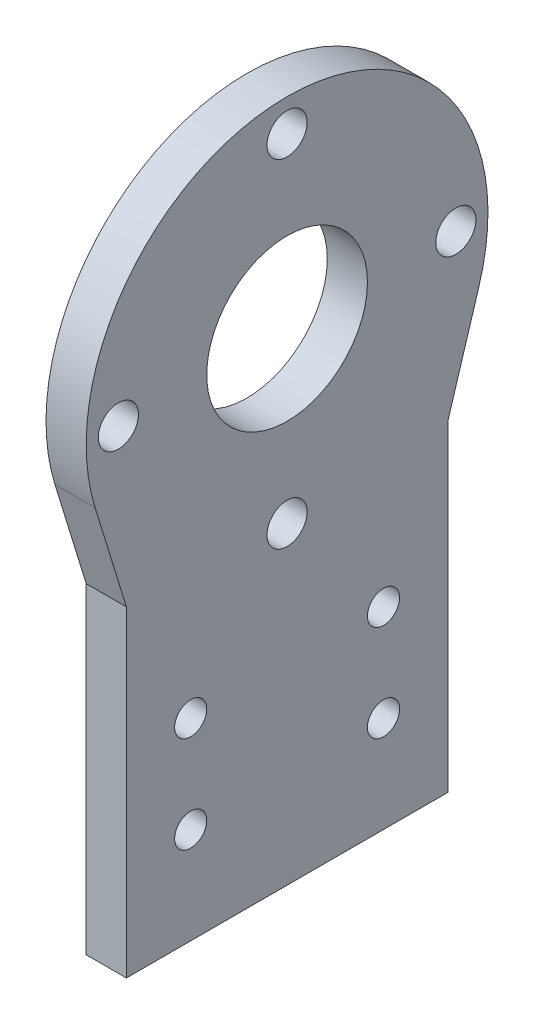
ISO-10303-21;
HEADER;
FILE_DESCRIPTION(('STEP AP214'),'2;1');
FILE_NAME('part.step','',(''),(''),'','','');
FILE_SCHEMA(('AUTOMOTIVE_DESIGN { 1 0 10303 214 1 1 1 1 }'));
ENDSEC;
DATA;
#1=APPLICATION_CONTEXT('core data for automotive mechanical design processes');
#2=APPLICATION_PROTOCOL_DEFINITION('international standard','automotive_design',2000,#1);
#3=PRODUCT_CONTEXT('',#1,'mechanical');
#4=PRODUCT('Part','Part','',(#3));
#5=PRODUCT_RELATED_PRODUCT_CATEGORY('part','',(#4));
#6=PRODUCT_DEFINITION_FORMATION('','',#4);
#7=PRODUCT_DEFINITION_CONTEXT('part definition',#1,'design');
#8=PRODUCT_DEFINITION('design','',#6,#7);
#9=PRODUCT_DEFINITION_SHAPE('','',#8);
#10=(LENGTH_UNIT() NAMED_UNIT(*) SI_UNIT(.MILLI.,.METRE.));
#11=(NAMED_UNIT(*) PLANE_ANGLE_UNIT() SI_UNIT($,.RADIAN.));
#12=(NAMED_UNIT(*) SI_UNIT($,.STERADIAN.) SOLID_ANGLE_UNIT());
#13=UNCERTAINTY_MEASURE_WITH_UNIT(LENGTH_MEASURE(1.E-05),#10,'distance_accuracy_value','');
#14=(GEOMETRIC_REPRESENTATION_CONTEXT(3) GLOBAL_UNCERTAINTY_ASSIGNED_CONTEXT((#13)) GLOBAL_UNIT_ASSIGNED_CONTEXT((#10,
#11,#12)) REPRESENTATION_CONTEXT('',''));
#15=CARTESIAN_POINT('',(0.,0.,0.));
#16=DIRECTION('',(0.,0.,1.));
#17=DIRECTION('',(1.,0.,0.));
#18=AXIS2_PLACEMENT_3D('',#15,#16,#17);
#19=CARTESIAN_POINT('',(5.,-1.38777878078145E-13,-40.));
#20=DIRECTION('',(0.,0.,-1.));
#21=DIRECTION('',(0.,1.,0.));
#22=AXIS2_PLACEMENT_3D('',#19,#20,#21);
#23=PLANE('',#22);
#24=DIRECTION('',(0.,-1.,0.));
#25=VECTOR('',#24,1.);
#26=CARTESIAN_POINT('',(0.,-1.38777878078145E-13,-40.));
#27=LINE('',#26,#25);
#28=CARTESIAN_POINT('',(0.,40.,-40.0000000000001));
#29=VERTEX_POINT('',#28);
#30=CARTESIAN_POINT('',(0.,0.,-40.));
#31=VERTEX_POINT('',#30);
#32=EDGE_CURVE('E146',#29,#31,#27,.T.);
#33=ORIENTED_EDGE('',*,*,#32,.F.);
#34=DIRECTION('',(-1.,0.,0.));
#35=VECTOR('',#34,1.);
#36=CARTESIAN_POINT('',(5.,40.,-40.0000000000001));
#37=LINE('',#36,#35);
#38=CARTESIAN_POINT('',(5.,40.,-40.0000000000001));
#39=VERTEX_POINT('',#38);
#40=EDGE_CURVE('E11',#39,#29,#37,.T.);
#41=ORIENTED_EDGE('',*,*,#40,.F.);
#42=DIRECTION('',(0.,-1.,0.));
#43=VECTOR('',#42,1.);
#44=CARTESIAN_POINT('',(5.,-1.38777878078145E-13,-40.));
#45=LINE('',#44,#43);
#46=CARTESIAN_POINT('',(5.,0.,-40.));
#47=VERTEX_POINT('',#46);
#48=EDGE_CURVE('E186',#39,#47,#45,.T.);
#49=ORIENTED_EDGE('',*,*,#48,.T.);
#50=DIRECTION('',(-1.,0.,0.));
#51=VECTOR('',#50,1.);
#52=CARTESIAN_POINT('',(5.,0.,-40.));
#53=LINE('',#52,#51);
#54=EDGE_CURVE('E81',#47,#31,#53,.T.);
#55=ORIENTED_EDGE('',*,*,#54,.T.);
#56=EDGE_LOOP('',(#33,#41,#49,#55));
#57=FACE_BOUND('',#56,.T.);
#58=ADVANCED_FACE('F37',(#57),#23,.T.);
#59=CARTESIAN_POINT('',(5.,-7.78594569415362,-25.2859456941544));
#60=DIRECTION('',(0.,0.294281086116916,0.955718913883077));
#61=DIRECTION('',(0.,-0.955718913883077,0.294281086116916));
#62=AXIS2_PLACEMENT_3D('',#59,#60,#61);
#63=PLANE('',#62);
#64=DIRECTION('',(0.,0.955718913883077,-0.294281086116916));
#65=VECTOR('',#64,1.);
#66=CARTESIAN_POINT('',(0.,-7.78594569415362,-25.2859456941544));
#67=LINE('',#66,#65);
#68=CARTESIAN_POINT('',(0.,52.6429728470771,-43.8929728470769));
#69=VERTEX_POINT('',#68);
#70=EDGE_CURVE('E149',#29,#69,#67,.T.);
#71=ORIENTED_EDGE('',*,*,#70,.T.);
#72=DIRECTION('',(-1.,0.,0.));
#73=VECTOR('',#72,1.);
#74=CARTESIAN_POINT('',(5.,52.6429728470771,-43.8929728470769));
#75=LINE('',#74,#73);
#76=CARTESIAN_POINT('',(5.,52.6429728470771,-43.8929728470769));
#77=VERTEX_POINT('',#76);
#78=EDGE_CURVE('E45',#77,#69,#75,.T.);
#79=ORIENTED_EDGE('',*,*,#78,.F.);
#80=DIRECTION('',(0.,0.955718913883077,-0.294281086116916));
#81=VECTOR('',#80,1.);
#82=CARTESIAN_POINT('',(5.,-7.78594569415362,-25.2859456941544));
#83=LINE('',#82,#81);
#84=EDGE_CURVE('E200',#39,#77,#83,.T.);
#85=ORIENTED_EDGE('',*,*,#84,.F.);
#86=ORIENTED_EDGE('',*,*,#40,.T.);
#87=EDGE_LOOP('',(#71,#79,#85,#86));
#88=FACE_BOUND('',#87,.T.);
#89=ADVANCED_FACE('F203',(#88),#63,.F.);
#90=CARTESIAN_POINT('',(5.,60.,-20.));
#91=DIRECTION('',(-1.,0.,0.));
#92=DIRECTION('',(0.,0.,1.));
#93=AXIS2_PLACEMENT_3D('',#90,#91,#92);
#94=CYLINDRICAL_SURFACE('',#93,25.);
#95=CARTESIAN_POINT('',(0.,60.,-20.));
#96=DIRECTION('',(1.,0.,0.));
#97=DIRECTION('',(0.,0.,-1.));
#98=AXIS2_PLACEMENT_3D('',#95,#96,#97);
#99=CIRCLE('',#98,25.);
#100=CARTESIAN_POINT('',(0.,52.6429728470771,3.89297284707693));
#101=VERTEX_POINT('',#100);
#102=EDGE_CURVE('E151',#69,#101,#99,.T.);
#103=ORIENTED_EDGE('',*,*,#102,.T.);
#104=DIRECTION('',(-1.,0.,0.));
#105=VECTOR('',#104,1.);
#106=CARTESIAN_POINT('',(5.,52.6429728470771,3.89297284707693));
#107=LINE('',#106,#105);
#108=CARTESIAN_POINT('',(5.,52.6429728470771,3.89297284707693));
#109=VERTEX_POINT('',#108);
#110=EDGE_CURVE('E105',#109,#101,#107,.T.);
#111=ORIENTED_EDGE('',*,*,#110,.F.);
#112=CARTESIAN_POINT('',(5.,60.,-20.));
#113=DIRECTION('',(1.,0.,0.));
#114=DIRECTION('',(0.,0.,-1.));
#115=AXIS2_PLACEMENT_3D('',#112,#113,#114);
#116=CIRCLE('',#115,25.);
#117=EDGE_CURVE('E111',#77,#109,#116,.T.);
#118=ORIENTED_EDGE('',*,*,#117,.F.);
#119=ORIENTED_EDGE('',*,*,#78,.T.);
#120=EDGE_LOOP('',(#103,#111,#118,#119));
#121=FACE_BOUND('',#120,.T.);
#122=ADVANCED_FACE('F193',(#121),#94,.T.);
#123=CARTESIAN_POINT('',(5.,3.46405430584603,-11.2499999999995));
#124=DIRECTION('',(0.,-0.294281086116916,0.955718913883077));
#125=DIRECTION('',(0.,-0.955718913883077,-0.294281086116916));
#126=AXIS2_PLACEMENT_3D('',#123,#124,#125);
#127=PLANE('',#126);
#128=DIRECTION('',(0.,0.955718913883077,0.294281086116916));
#129=VECTOR('',#128,1.);
#130=CARTESIAN_POINT('',(0.,3.46405430584603,-11.2499999999995));
#131=LINE('',#130,#129);
#132=CARTESIAN_POINT('',(0.,40.,1.49456427946904E-13));
#133=VERTEX_POINT('',#132);
#134=EDGE_CURVE('E100',#133,#101,#131,.T.);
#135=ORIENTED_EDGE('',*,*,#134,.F.);
#136=DIRECTION('',(-1.,0.,0.));
#137=VECTOR('',#136,1.);
#138=CARTESIAN_POINT('',(5.,40.,1.49456427946904E-13));
#139=LINE('',#138,#137);
#140=CARTESIAN_POINT('',(5.,40.,1.49456427946904E-13));
#141=VERTEX_POINT('',#140);
#142=EDGE_CURVE('E95',#141,#133,#139,.T.);
#143=ORIENTED_EDGE('',*,*,#142,.F.);
#144=DIRECTION('',(0.,0.955718913883077,0.294281086116916));
#145=VECTOR('',#144,1.);
#146=CARTESIAN_POINT('',(5.,3.46405430584603,-11.2499999999995));
#147=LINE('',#146,#145);
#148=EDGE_CURVE('E98',#141,#109,#147,.T.);
#149=ORIENTED_EDGE('',*,*,#148,.T.);
#150=ORIENTED_EDGE('',*,*,#110,.T.);
#151=EDGE_LOOP('',(#135,#143,#149,#150));
#152=FACE_BOUND('',#151,.T.);
#153=ADVANCED_FACE('F97',(#152),#127,.T.);
#154=CARTESIAN_POINT('',(5.,0.,0.));
#155=DIRECTION('',(0.,0.,1.));
#156=DIRECTION('',(0.,-1.,0.));
#157=AXIS2_PLACEMENT_3D('',#154,#155,#156);
#158=PLANE('',#157);
#159=DIRECTION('',(0.,1.,0.));
#160=VECTOR('',#159,1.);
#161=CARTESIAN_POINT('',(0.,0.,0.));
#162=LINE('',#161,#160);
#163=CARTESIAN_POINT('',(0.,0.,0.));
#164=VERTEX_POINT('',#163);
#165=EDGE_CURVE('E155',#164,#133,#162,.T.);
#166=ORIENTED_EDGE('',*,*,#165,.F.);
#167=DIRECTION('',(-1.,0.,0.));
#168=VECTOR('',#167,1.);
#169=CARTESIAN_POINT('',(5.,0.,0.));
#170=LINE('',#169,#168);
#171=CARTESIAN_POINT('',(5.,0.,0.));
#172=VERTEX_POINT('',#171);
#173=EDGE_CURVE('E74',#172,#164,#170,.T.);
#174=ORIENTED_EDGE('',*,*,#173,.F.);
#175=DIRECTION('',(0.,1.,0.));
#176=VECTOR('',#175,1.);
#177=CARTESIAN_POINT('',(5.,0.,0.));
#178=LINE('',#177,#176);
#179=EDGE_CURVE('E109',#172,#141,#178,.T.);
#180=ORIENTED_EDGE('',*,*,#179,.T.);
#181=ORIENTED_EDGE('',*,*,#142,.T.);
#182=EDGE_LOOP('',(#166,#174,#180,#181));
#183=FACE_BOUND('',#182,.T.);
#184=ADVANCED_FACE('F114',(#183),#158,.T.);
#185=CARTESIAN_POINT('',(5.,24.,-8.));
#186=DIRECTION('',(-1.,0.,0.));
#187=DIRECTION('',(0.,0.,1.));
#188=AXIS2_PLACEMENT_3D('',#185,#186,#187);
#189=CYLINDRICAL_SURFACE('',#188,2.00000000000001);
#190=CARTESIAN_POINT('',(5.,24.,-8.));
#191=DIRECTION('',(1.,0.,0.));
#192=DIRECTION('',(0.,0.,-1.));
#193=AXIS2_PLACEMENT_3D('',#190,#191,#192);
#194=CIRCLE('',#193,2.00000000000001);
#195=CARTESIAN_POINT('',(5.,24.,-10.));
#196=VERTEX_POINT('',#195);
#197=EDGE_CURVE('E140',#196,#196,#194,.T.);
#198=ORIENTED_EDGE('',*,*,#197,.T.);
#199=EDGE_LOOP('',(#198));
#200=FACE_BOUND('',#199,.T.);
#201=CARTESIAN_POINT('',(0.,24.,-8.));
#202=DIRECTION('',(1.,0.,0.));
#203=DIRECTION('',(0.,0.,-1.));
#204=AXIS2_PLACEMENT_3D('',#201,#202,#203);
#205=CIRCLE('',#204,2.00000000000001);
#206=CARTESIAN_POINT('',(0.,24.,-10.));
#207=VERTEX_POINT('',#206);
#208=EDGE_CURVE('E180',#207,#207,#205,.T.);
#209=ORIENTED_EDGE('',*,*,#208,.F.);
#210=EDGE_LOOP('',(#209));
#211=FACE_BOUND('',#210,.T.);
#212=ADVANCED_FACE('F215',(#200,#211),#189,.F.);
#213=CARTESIAN_POINT('',(5.,12.,-8.));
#214=DIRECTION('',(-1.,0.,0.));
#215=DIRECTION('',(0.,0.,1.));
#216=AXIS2_PLACEMENT_3D('',#213,#214,#215);
#217=CYLINDRICAL_SURFACE('',#216,2.);
#218=CARTESIAN_POINT('',(5.,12.,-8.));
#219=DIRECTION('',(1.,0.,0.));
#220=DIRECTION('',(0.,0.,-1.));
#221=AXIS2_PLACEMENT_3D('',#218,#219,#220);
#222=CIRCLE('',#221,2.);
#223=CARTESIAN_POINT('',(5.,12.,-10.));
#224=VERTEX_POINT('',#223);
#225=EDGE_CURVE('E137',#224,#224,#222,.T.);
#226=ORIENTED_EDGE('',*,*,#225,.T.);
#227=EDGE_LOOP('',(#226));
#228=FACE_BOUND('',#227,.T.);
#229=CARTESIAN_POINT('',(0.,12.,-8.));
#230=DIRECTION('',(1.,0.,0.));
#231=DIRECTION('',(0.,0.,-1.));
#232=AXIS2_PLACEMENT_3D('',#229,#230,#231);
#233=CIRCLE('',#232,2.);
#234=CARTESIAN_POINT('',(0.,12.,-10.));
#235=VERTEX_POINT('',#234);
#236=EDGE_CURVE('E177',#235,#235,#233,.T.);
#237=ORIENTED_EDGE('',*,*,#236,.F.);
#238=EDGE_LOOP('',(#237));
#239=FACE_BOUND('',#238,.T.);
#240=ADVANCED_FACE('F242',(#228,#239),#217,.F.);
#241=CARTESIAN_POINT('',(5.,12.,-32.));
#242=DIRECTION('',(-1.,0.,0.));
#243=DIRECTION('',(0.,0.,1.));
#244=AXIS2_PLACEMENT_3D('',#241,#242,#243);
#245=CYLINDRICAL_SURFACE('',#244,2.);
#246=CARTESIAN_POINT('',(5.,12.,-32.));
#247=DIRECTION('',(1.,0.,0.));
#248=DIRECTION('',(0.,0.,-1.));
#249=AXIS2_PLACEMENT_3D('',#246,#247,#248);
#250=CIRCLE('',#249,2.);
#251=CARTESIAN_POINT('',(5.,12.,-34.));
#252=VERTEX_POINT('',#251);
#253=EDGE_CURVE('E134',#252,#252,#250,.F.);
#254=ORIENTED_EDGE('',*,*,#253,.F.);
#255=EDGE_LOOP('',(#254));
#256=FACE_BOUND('',#255,.T.);
#257=CARTESIAN_POINT('',(0.,12.,-32.));
#258=DIRECTION('',(1.,0.,0.));
#259=DIRECTION('',(0.,0.,-1.));
#260=AXIS2_PLACEMENT_3D('',#257,#258,#259);
#261=CIRCLE('',#260,2.);
#262=CARTESIAN_POINT('',(0.,12.,-34.));
#263=VERTEX_POINT('',#262);
#264=EDGE_CURVE('E174',#263,#263,#261,.F.);
#265=ORIENTED_EDGE('',*,*,#264,.T.);
#266=EDGE_LOOP('',(#265));
#267=FACE_BOUND('',#266,.T.);
#268=ADVANCED_FACE('F238',(#256,#267),#245,.F.);
#269=CARTESIAN_POINT('',(5.,60.,-20.));
#270=DIRECTION('',(-1.,0.,0.));
#271=DIRECTION('',(0.,0.,1.));
#272=AXIS2_PLACEMENT_3D('',#269,#270,#271);
#273=CYLINDRICAL_SURFACE('',#272,10.);
#274=CARTESIAN_POINT('',(5.,60.,-20.));
#275=DIRECTION('',(1.,0.,0.));
#276=DIRECTION('',(0.,0.,-1.));
#277=AXIS2_PLACEMENT_3D('',#274,#275,#276);
#278=CIRCLE('',#277,10.);
#279=CARTESIAN_POINT('',(5.,60.,-30.));
#280=VERTEX_POINT('',#279);
#281=EDGE_CURVE('E131',#280,#280,#278,.T.);
#282=ORIENTED_EDGE('',*,*,#281,.T.);
#283=EDGE_LOOP('',(#282));
#284=FACE_BOUND('',#283,.T.);
#285=CARTESIAN_POINT('',(0.,60.,-20.));
#286=DIRECTION('',(1.,0.,0.));
#287=DIRECTION('',(0.,0.,-1.));
#288=AXIS2_PLACEMENT_3D('',#285,#286,#287);
#289=CIRCLE('',#288,10.);
#290=CARTESIAN_POINT('',(0.,60.,-30.));
#291=VERTEX_POINT('',#290);
#292=EDGE_CURVE('E171',#291,#291,#289,.T.);
#293=ORIENTED_EDGE('',*,*,#292,.F.);
#294=EDGE_LOOP('',(#293));
#295=FACE_BOUND('',#294,.T.);
#296=ADVANCED_FACE('F234',(#284,#295),#273,.F.);
#297=CARTESIAN_POINT('',(5.,81.,-20.));
#298=DIRECTION('',(-1.,0.,0.));
#299=DIRECTION('',(0.,0.,1.));
#300=AXIS2_PLACEMENT_3D('',#297,#298,#299);
#301=CYLINDRICAL_SURFACE('',#300,2.5);
#302=CARTESIAN_POINT('',(5.,81.,-20.));
#303=DIRECTION('',(1.,0.,0.));
#304=DIRECTION('',(0.,0.,-1.));
#305=AXIS2_PLACEMENT_3D('',#302,#303,#304);
#306=CIRCLE('',#305,2.5);
#307=CARTESIAN_POINT('',(5.,81.,-22.5));
#308=VERTEX_POINT('',#307);
#309=EDGE_CURVE('E128',#308,#308,#306,.T.);
#310=ORIENTED_EDGE('',*,*,#309,.T.);
#311=EDGE_LOOP('',(#310));
#312=FACE_BOUND('',#311,.T.);
#313=CARTESIAN_POINT('',(0.,81.,-20.));
#314=DIRECTION('',(1.,0.,0.));
#315=DIRECTION('',(0.,0.,-1.));
#316=AXIS2_PLACEMENT_3D('',#313,#314,#315);
#317=CIRCLE('',#316,2.5);
#318=CARTESIAN_POINT('',(0.,81.,-22.5));
#319=VERTEX_POINT('',#318);
#320=EDGE_CURVE('E168',#319,#319,#317,.T.);
#321=ORIENTED_EDGE('',*,*,#320,.F.);
#322=EDGE_LOOP('',(#321));
#323=FACE_BOUND('',#322,.T.);
#324=ADVANCED_FACE('F230',(#312,#323),#301,.F.);
#325=CARTESIAN_POINT('',(5.,60.0000000000002,-41.0000000000002));
#326=DIRECTION('',(-1.,0.,0.));
#327=DIRECTION('',(0.,0.,1.));
#328=AXIS2_PLACEMENT_3D('',#325,#326,#327);
#329=CYLINDRICAL_SURFACE('',#328,2.5);
#330=CARTESIAN_POINT('',(5.,60.0000000000002,-41.0000000000002));
#331=DIRECTION('',(1.,0.,0.));
#332=DIRECTION('',(0.,0.,-1.));
#333=AXIS2_PLACEMENT_3D('',#330,#331,#332);
#334=CIRCLE('',#333,2.5);
#335=CARTESIAN_POINT('',(5.,60.0000000000002,-43.5000000000002));
#336=VERTEX_POINT('',#335);
#337=EDGE_CURVE('E125',#336,#336,#334,.T.);
#338=ORIENTED_EDGE('',*,*,#337,.T.);
#339=EDGE_LOOP('',(#338));
#340=FACE_BOUND('',#339,.T.);
#341=CARTESIAN_POINT('',(0.,60.0000000000002,-41.0000000000002));
#342=DIRECTION('',(1.,0.,0.));
#343=DIRECTION('',(0.,0.,-1.));
#344=AXIS2_PLACEMENT_3D('',#341,#342,#343);
#345=CIRCLE('',#344,2.5);
#346=CARTESIAN_POINT('',(0.,60.0000000000002,-43.5000000000002));
#347=VERTEX_POINT('',#346);
#348=EDGE_CURVE('E165',#347,#347,#345,.T.);
#349=ORIENTED_EDGE('',*,*,#348,.F.);
#350=EDGE_LOOP('',(#349));
#351=FACE_BOUND('',#350,.T.);
#352=ADVANCED_FACE('F226',(#340,#351),#329,.F.);
#353=CARTESIAN_POINT('',(5.,39.,-20.0000000000004));
#354=DIRECTION('',(-1.,0.,0.));
#355=DIRECTION('',(0.,0.,1.));
#356=AXIS2_PLACEMENT_3D('',#353,#354,#355);
#357=CYLINDRICAL_SURFACE('',#356,2.5);
#358=CARTESIAN_POINT('',(5.,39.,-20.0000000000004));
#359=DIRECTION('',(1.,0.,0.));
#360=DIRECTION('',(0.,0.,-1.));
#361=AXIS2_PLACEMENT_3D('',#358,#359,#360);
#362=CIRCLE('',#361,2.5);
#363=CARTESIAN_POINT('',(5.,39.,-22.5000000000004));
#364=VERTEX_POINT('',#363);
#365=EDGE_CURVE('E122',#364,#364,#362,.T.);
#366=ORIENTED_EDGE('',*,*,#365,.T.);
#367=EDGE_LOOP('',(#366));
#368=FACE_BOUND('',#367,.T.);
#369=CARTESIAN_POINT('',(0.,39.,-20.0000000000004));
#370=DIRECTION('',(1.,0.,0.));
#371=DIRECTION('',(0.,0.,-1.));
#372=AXIS2_PLACEMENT_3D('',#369,#370,#371);
#373=CIRCLE('',#372,2.5);
#374=CARTESIAN_POINT('',(0.,39.,-22.5000000000004));
#375=VERTEX_POINT('',#374);
#376=EDGE_CURVE('E162',#375,#375,#373,.T.);
#377=ORIENTED_EDGE('',*,*,#376,.F.);
#378=EDGE_LOOP('',(#377));
#379=FACE_BOUND('',#378,.T.);
#380=ADVANCED_FACE('F222',(#368,#379),#357,.F.);
#381=CARTESIAN_POINT('',(5.,59.9999999999998,0.999999999999793));
#382=DIRECTION('',(-1.,0.,0.));
#383=DIRECTION('',(0.,0.,1.));
#384=AXIS2_PLACEMENT_3D('',#381,#382,#383);
#385=CYLINDRICAL_SURFACE('',#384,2.5);
#386=CARTESIAN_POINT('',(5.,59.9999999999998,0.999999999999793));
#387=DIRECTION('',(1.,0.,0.));
#388=DIRECTION('',(0.,0.,-1.));
#389=AXIS2_PLACEMENT_3D('',#386,#387,#388);
#390=CIRCLE('',#389,2.5);
#391=CARTESIAN_POINT('',(5.,59.9999999999998,-1.50000000000021));
#392=VERTEX_POINT('',#391);
#393=EDGE_CURVE('E116',#392,#392,#390,.T.);
#394=ORIENTED_EDGE('',*,*,#393,.T.);
#395=EDGE_LOOP('',(#394));
#396=FACE_BOUND('',#395,.T.);
#397=CARTESIAN_POINT('',(0.,59.9999999999998,0.999999999999793));
#398=DIRECTION('',(1.,0.,0.));
#399=DIRECTION('',(0.,0.,-1.));
#400=AXIS2_PLACEMENT_3D('',#397,#398,#399);
#401=CIRCLE('',#400,2.5);
#402=CARTESIAN_POINT('',(0.,59.9999999999998,-1.50000000000021));
#403=VERTEX_POINT('',#402);
#404=EDGE_CURVE('E159',#403,#403,#401,.T.);
#405=ORIENTED_EDGE('',*,*,#404,.F.);
#406=EDGE_LOOP('',(#405));
#407=FACE_BOUND('',#406,.T.);
#408=ADVANCED_FACE('F219',(#396,#407),#385,.F.);
#409=CARTESIAN_POINT('',(5.,0.,0.));
#410=DIRECTION('',(0.,1.,0.));
#411=DIRECTION('',(0.,0.,1.));
#412=AXIS2_PLACEMENT_3D('',#409,#410,#411);
#413=PLANE('',#412);
#414=DIRECTION('',(0.,0.,-1.));
#415=VECTOR('',#414,1.);
#416=CARTESIAN_POINT('',(0.,0.,0.));
#417=LINE('',#416,#415);
#418=EDGE_CURVE('E157',#164,#31,#417,.T.);
#419=ORIENTED_EDGE('',*,*,#418,.T.);
#420=ORIENTED_EDGE('',*,*,#54,.F.);
#421=DIRECTION('',(0.,0.,-1.));
#422=VECTOR('',#421,1.);
#423=CARTESIAN_POINT('',(5.,0.,0.));
#424=LINE('',#423,#422);
#425=EDGE_CURVE('E53',#172,#47,#424,.T.);
#426=ORIENTED_EDGE('',*,*,#425,.F.);
#427=ORIENTED_EDGE('',*,*,#173,.T.);
#428=EDGE_LOOP('',(#419,#420,#426,#427));
#429=FACE_BOUND('',#428,.T.);
#430=ADVANCED_FACE('F199',(#429),#413,.F.);
#431=CARTESIAN_POINT('',(5.,24.,-32.));
#432=DIRECTION('',(-1.,0.,0.));
#433=DIRECTION('',(0.,0.,1.));
#434=AXIS2_PLACEMENT_3D('',#431,#432,#433);
#435=CYLINDRICAL_SURFACE('',#434,2.00000000000001);
#436=CARTESIAN_POINT('',(5.,24.,-32.));
#437=DIRECTION('',(1.,0.,0.));
#438=DIRECTION('',(0.,0.,-1.));
#439=AXIS2_PLACEMENT_3D('',#436,#437,#438);
#440=CIRCLE('',#439,2.00000000000001);
#441=CARTESIAN_POINT('',(5.,24.,-34.));
#442=VERTEX_POINT('',#441);
#443=EDGE_CURVE('E143',#442,#442,#440,.F.);
#444=ORIENTED_EDGE('',*,*,#443,.F.);
#445=EDGE_LOOP('',(#444));
#446=FACE_BOUND('',#445,.T.);
#447=CARTESIAN_POINT('',(0.,24.,-32.));
#448=DIRECTION('',(1.,0.,0.));
#449=DIRECTION('',(0.,0.,-1.));
#450=AXIS2_PLACEMENT_3D('',#447,#448,#449);
#451=CIRCLE('',#450,2.00000000000001);
#452=CARTESIAN_POINT('',(0.,24.,-34.));
#453=VERTEX_POINT('',#452);
#454=EDGE_CURVE('E183',#453,#453,#451,.F.);
#455=ORIENTED_EDGE('',*,*,#454,.T.);
#456=EDGE_LOOP('',(#455));
#457=FACE_BOUND('',#456,.T.);
#458=ADVANCED_FACE('F218',(#446,#457),#435,.F.);
#459=CARTESIAN_POINT('',(5.,0.,0.));
#460=DIRECTION('',(1.,0.,0.));
#461=DIRECTION('',(0.,0.,-1.));
#462=AXIS2_PLACEMENT_3D('',#459,#460,#461);
#463=PLANE('',#462);
#464=ORIENTED_EDGE('',*,*,#48,.F.);
#465=ORIENTED_EDGE('',*,*,#84,.T.);
#466=ORIENTED_EDGE('',*,*,#117,.T.);
#467=ORIENTED_EDGE('',*,*,#148,.F.);
#468=ORIENTED_EDGE('',*,*,#179,.F.);
#469=ORIENTED_EDGE('',*,*,#425,.T.);
#470=EDGE_LOOP('',(#464,#465,#466,#467,#468,#469));
#471=FACE_BOUND('',#470,.T.);
#472=ORIENTED_EDGE('',*,*,#393,.F.);
#473=EDGE_LOOP('',(#472));
#474=FACE_BOUND('',#473,.T.);
#475=ORIENTED_EDGE('',*,*,#365,.F.);
#476=EDGE_LOOP('',(#475));
#477=FACE_BOUND('',#476,.T.);
#478=ORIENTED_EDGE('',*,*,#337,.F.);
#479=EDGE_LOOP('',(#478));
#480=FACE_BOUND('',#479,.T.);
#481=ORIENTED_EDGE('',*,*,#309,.F.);
#482=EDGE_LOOP('',(#481));
#483=FACE_BOUND('',#482,.T.);
#484=ORIENTED_EDGE('',*,*,#281,.F.);
#485=EDGE_LOOP('',(#484));
#486=FACE_BOUND('',#485,.T.);
#487=ORIENTED_EDGE('',*,*,#253,.T.);
#488=EDGE_LOOP('',(#487));
#489=FACE_BOUND('',#488,.T.);
#490=ORIENTED_EDGE('',*,*,#225,.F.);
#491=EDGE_LOOP('',(#490));
#492=FACE_BOUND('',#491,.T.);
#493=ORIENTED_EDGE('',*,*,#197,.F.);
#494=EDGE_LOOP('',(#493));
#495=FACE_BOUND('',#494,.T.);
#496=ORIENTED_EDGE('',*,*,#443,.T.);
#497=EDGE_LOOP('',(#496));
#498=FACE_BOUND('',#497,.T.);
#499=ADVANCED_FACE('F107',(#471,#474,#477,#480,#483,#486,#489,#492,#495,#498),#463,.T.);
#500=CARTESIAN_POINT('',(0.,0.,0.));
#501=DIRECTION('',(1.,0.,0.));
#502=DIRECTION('',(0.,0.,-1.));
#503=AXIS2_PLACEMENT_3D('',#500,#501,#502);
#504=PLANE('',#503);
#505=ORIENTED_EDGE('',*,*,#32,.T.);
#506=ORIENTED_EDGE('',*,*,#418,.F.);
#507=ORIENTED_EDGE('',*,*,#165,.T.);
#508=ORIENTED_EDGE('',*,*,#134,.T.);
#509=ORIENTED_EDGE('',*,*,#102,.F.);
#510=ORIENTED_EDGE('',*,*,#70,.F.);
#511=EDGE_LOOP('',(#505,#506,#507,#508,#509,#510));
#512=FACE_BOUND('',#511,.T.);
#513=ORIENTED_EDGE('',*,*,#404,.T.);
#514=EDGE_LOOP('',(#513));
#515=FACE_BOUND('',#514,.T.);
#516=ORIENTED_EDGE('',*,*,#376,.T.);
#517=EDGE_LOOP('',(#516));
#518=FACE_BOUND('',#517,.T.);
#519=ORIENTED_EDGE('',*,*,#348,.T.);
#520=EDGE_LOOP('',(#519));
#521=FACE_BOUND('',#520,.T.);
#522=ORIENTED_EDGE('',*,*,#320,.T.);
#523=EDGE_LOOP('',(#522));
#524=FACE_BOUND('',#523,.T.);
#525=ORIENTED_EDGE('',*,*,#292,.T.);
#526=EDGE_LOOP('',(#525));
#527=FACE_BOUND('',#526,.T.);
#528=ORIENTED_EDGE('',*,*,#264,.F.);
#529=EDGE_LOOP('',(#528));
#530=FACE_BOUND('',#529,.T.);
#531=ORIENTED_EDGE('',*,*,#236,.T.);
#532=EDGE_LOOP('',(#531));
#533=FACE_BOUND('',#532,.T.);
#534=ORIENTED_EDGE('',*,*,#208,.T.);
#535=EDGE_LOOP('',(#534));
#536=FACE_BOUND('',#535,.T.);
#537=ORIENTED_EDGE('',*,*,#454,.F.);
#538=EDGE_LOOP('',(#537));
#539=FACE_BOUND('',#538,.T.);
#540=ADVANCED_FACE('F197',(#512,#515,#518,#521,#524,#527,#530,#533,#536,#539),#504,.F.);
#541=CLOSED_SHELL('',(#58,#89,#122,#153,#184,#212,#240,#268,#296,#324,#352,#380,#408,#430,#458,
#499,#540));
#542=MANIFOLD_SOLID_BREP('B2',#541);
#543=ADVANCED_BREP_SHAPE_REPRESENTATION('',(#18,#542),#14);
#544=SHAPE_DEFINITION_REPRESENTATION(#9,#543);
ENDSEC;
END-ISO-10303-21;
